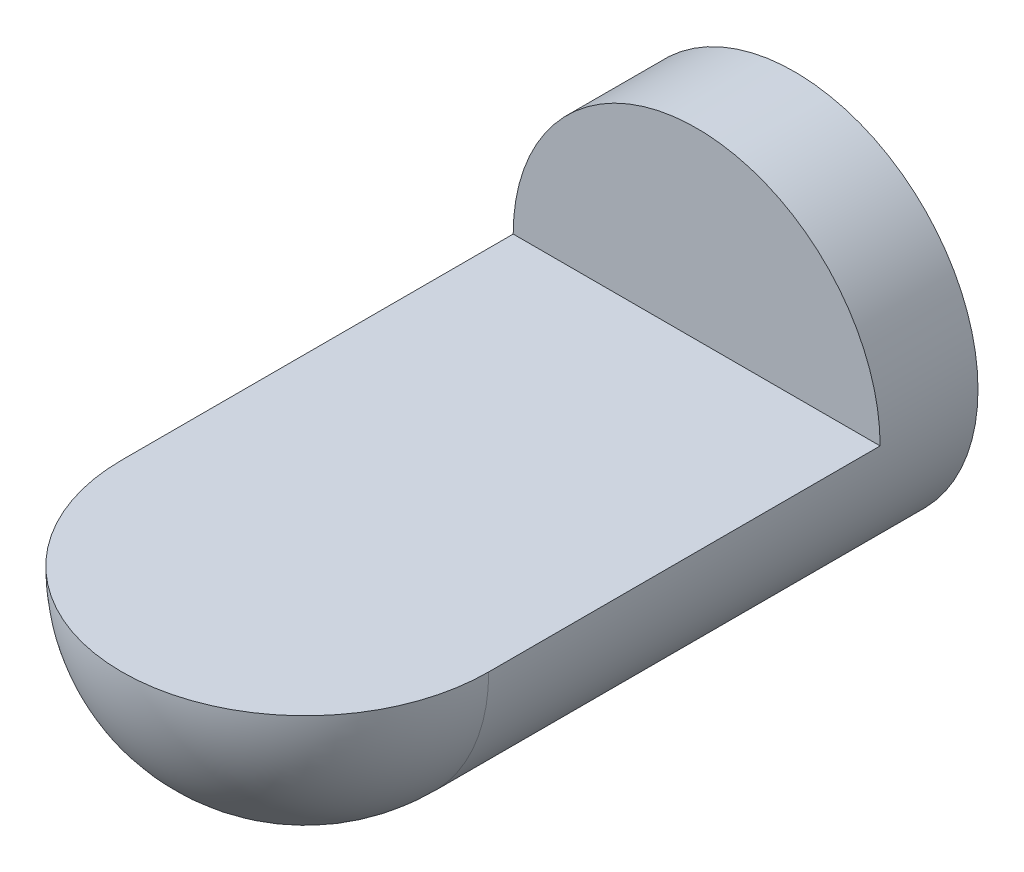
ISO-10303-21;
HEADER;
FILE_DESCRIPTION(('STEP AP214'),'2;1');
FILE_NAME('part.step','',(''),(''),'','','');
FILE_SCHEMA(('AUTOMOTIVE_DESIGN { 1 0 10303 214 1 1 1 1 }'));
ENDSEC;
DATA;
#1=APPLICATION_CONTEXT('core data for automotive mechanical design processes');
#2=APPLICATION_PROTOCOL_DEFINITION('international standard','automotive_design',2000,#1);
#3=PRODUCT_CONTEXT('',#1,'mechanical');
#4=PRODUCT('Part','Part','',(#3));
#5=PRODUCT_RELATED_PRODUCT_CATEGORY('part','',(#4));
#6=PRODUCT_DEFINITION_FORMATION('','',#4);
#7=PRODUCT_DEFINITION_CONTEXT('part definition',#1,'design');
#8=PRODUCT_DEFINITION('design','',#6,#7);
#9=PRODUCT_DEFINITION_SHAPE('','',#8);
#10=(LENGTH_UNIT() NAMED_UNIT(*) SI_UNIT(.MILLI.,.METRE.));
#11=(NAMED_UNIT(*) PLANE_ANGLE_UNIT() SI_UNIT($,.RADIAN.));
#12=(NAMED_UNIT(*) SI_UNIT($,.STERADIAN.) SOLID_ANGLE_UNIT());
#13=UNCERTAINTY_MEASURE_WITH_UNIT(LENGTH_MEASURE(1.E-05),#10,'distance_accuracy_value','');
#14=(GEOMETRIC_REPRESENTATION_CONTEXT(3) GLOBAL_UNCERTAINTY_ASSIGNED_CONTEXT((#13)) GLOBAL_UNIT_ASSIGNED_CONTEXT((#10,
#11,#12)) REPRESENTATION_CONTEXT('',''));
#15=CARTESIAN_POINT('',(0.,0.,0.));
#16=DIRECTION('',(0.,0.,1.));
#17=DIRECTION('',(1.,0.,0.));
#18=AXIS2_PLACEMENT_3D('',#15,#16,#17);
#19=CARTESIAN_POINT('',(0.,0.,0.));
#20=DIRECTION('',(0.,0.,1.));
#21=DIRECTION('',(0.,1.,0.));
#22=AXIS2_PLACEMENT_3D('',#19,#20,#21);
#23=SPHERICAL_SURFACE('',#22,75.);
#24=CARTESIAN_POINT('',(0.,0.,0.));
#25=DIRECTION('',(0.,1.,0.));
#26=DIRECTION('',(0.,0.,1.));
#27=AXIS2_PLACEMENT_3D('',#24,#25,#26);
#28=CIRCLE('',#27,75.);
#29=CARTESIAN_POINT('',(-75.,0.,0.));
#30=VERTEX_POINT('',#29);
#31=CARTESIAN_POINT('',(75.,0.,0.));
#32=VERTEX_POINT('',#31);
#33=EDGE_CURVE('E57',#30,#32,#28,.T.);
#34=ORIENTED_EDGE('',*,*,#33,.F.);
#35=CARTESIAN_POINT('',(0.,0.,0.));
#36=DIRECTION('',(0.,0.,1.));
#37=DIRECTION('',(1.,0.,0.));
#38=AXIS2_PLACEMENT_3D('',#35,#36,#37);
#39=CIRCLE('',#38,75.);
#40=EDGE_CURVE('E78',#30,#32,#39,.T.);
#41=ORIENTED_EDGE('',*,*,#40,.T.);
#42=EDGE_LOOP('',(#34,#41));
#43=FACE_BOUND('',#42,.T.);
#44=ADVANCED_FACE('F38',(#43),#23,.T.);
#45=CARTESIAN_POINT('',(0.,0.,146.909145290857));
#46=DIRECTION('',(0.,0.,1.));
#47=DIRECTION('',(1.,0.,0.));
#48=AXIS2_PLACEMENT_3D('',#45,#46,#47);
#49=CYLINDRICAL_SURFACE('',#48,75.);
#50=CARTESIAN_POINT('',(0.,0.,-200.));
#51=DIRECTION('',(0.,0.,1.));
#52=DIRECTION('',(1.,0.,0.));
#53=AXIS2_PLACEMENT_3D('',#50,#51,#52);
#54=CIRCLE('',#53,75.);
#55=CARTESIAN_POINT('',(75.,0.,-200.));
#56=VERTEX_POINT('',#55);
#57=EDGE_CURVE('E73',#56,#56,#54,.T.);
#58=ORIENTED_EDGE('',*,*,#57,.T.);
#59=EDGE_LOOP('',(#58));
#60=FACE_BOUND('',#59,.T.);
#61=DIRECTION('',(0.,0.,1.));
#62=VECTOR('',#61,1.);
#63=CARTESIAN_POINT('',(75.,0.,146.909145290857));
#64=LINE('',#63,#62);
#65=CARTESIAN_POINT('',(75.,0.,-160.));
#66=VERTEX_POINT('',#65);
#67=EDGE_CURVE('E11',#32,#66,#64,.F.);
#68=ORIENTED_EDGE('',*,*,#67,.F.);
#69=ORIENTED_EDGE('',*,*,#40,.F.);
#70=DIRECTION('',(0.,0.,1.));
#71=VECTOR('',#70,1.);
#72=CARTESIAN_POINT('',(-75.,0.,146.909145290857));
#73=LINE('',#72,#71);
#74=CARTESIAN_POINT('',(-75.,0.,-160.));
#75=VERTEX_POINT('',#74);
#76=EDGE_CURVE('E68',#75,#30,#73,.T.);
#77=ORIENTED_EDGE('',*,*,#76,.F.);
#78=CARTESIAN_POINT('',(0.,0.,-160.));
#79=DIRECTION('',(0.,0.,1.));
#80=DIRECTION('',(1.,0.,0.));
#81=AXIS2_PLACEMENT_3D('',#78,#79,#80);
#82=CIRCLE('',#81,75.);
#83=EDGE_CURVE('E46',#66,#75,#82,.T.);
#84=ORIENTED_EDGE('',*,*,#83,.F.);
#85=EDGE_LOOP('',(#68,#69,#77,#84));
#86=FACE_BOUND('',#85,.T.);
#87=ADVANCED_FACE('F65',(#60,#86),#49,.T.);
#88=CARTESIAN_POINT('',(0.,0.,-200.));
#89=DIRECTION('',(0.,0.,1.));
#90=DIRECTION('',(1.,0.,0.));
#91=AXIS2_PLACEMENT_3D('',#88,#89,#90);
#92=PLANE('',#91);
#93=ORIENTED_EDGE('',*,*,#57,.F.);
#94=EDGE_LOOP('',(#93));
#95=FACE_BOUND('',#94,.T.);
#96=ADVANCED_FACE('F40',(#95),#92,.F.);
#97=CARTESIAN_POINT('',(75.,0.,-160.));
#98=DIRECTION('',(0.,1.,0.));
#99=DIRECTION('',(0.,0.,1.));
#100=AXIS2_PLACEMENT_3D('',#97,#98,#99);
#101=PLANE('',#100);
#102=ORIENTED_EDGE('',*,*,#33,.T.);
#103=ORIENTED_EDGE('',*,*,#67,.T.);
#104=DIRECTION('',(-1.,0.,0.));
#105=VECTOR('',#104,1.);
#106=CARTESIAN_POINT('',(75.,0.,-160.));
#107=LINE('',#106,#105);
#108=EDGE_CURVE('E52',#66,#75,#107,.T.);
#109=ORIENTED_EDGE('',*,*,#108,.T.);
#110=ORIENTED_EDGE('',*,*,#76,.T.);
#111=EDGE_LOOP('',(#102,#103,#109,#110));
#112=FACE_BOUND('',#111,.T.);
#113=ADVANCED_FACE('F70',(#112),#101,.T.);
#114=CARTESIAN_POINT('',(75.,0.,-160.));
#115=DIRECTION('',(0.,0.,1.));
#116=DIRECTION('',(1.,0.,0.));
#117=AXIS2_PLACEMENT_3D('',#114,#115,#116);
#118=PLANE('',#117);
#119=ORIENTED_EDGE('',*,*,#108,.F.);
#120=ORIENTED_EDGE('',*,*,#83,.T.);
#121=EDGE_LOOP('',(#119,#120));
#122=FACE_BOUND('',#121,.T.);
#123=ADVANCED_FACE('F71',(#122),#118,.T.);
#124=CLOSED_SHELL('',(#44,#87,#96,#113,#123));
#125=MANIFOLD_SOLID_BREP('B2',#124);
#126=ADVANCED_BREP_SHAPE_REPRESENTATION('',(#18,#125),#14);
#127=SHAPE_DEFINITION_REPRESENTATION(#9,#126);
ENDSEC;
END-ISO-10303-21;
